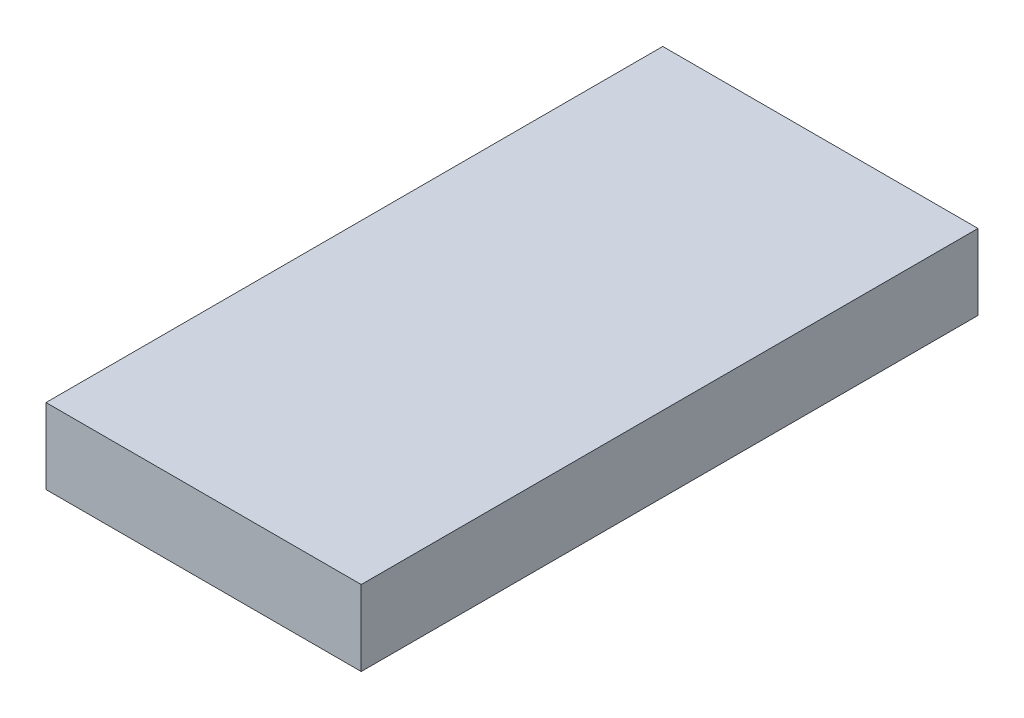
ISO-10303-21;
HEADER;
FILE_DESCRIPTION(('STEP AP214'),'2;1');
FILE_NAME('part.step','',(''),(''),'','','');
FILE_SCHEMA(('AUTOMOTIVE_DESIGN { 1 0 10303 214 1 1 1 1 }'));
ENDSEC;
DATA;
#1=APPLICATION_CONTEXT('core data for automotive mechanical design processes');
#2=APPLICATION_PROTOCOL_DEFINITION('international standard','automotive_design',2000,#1);
#3=PRODUCT_CONTEXT('',#1,'mechanical');
#4=PRODUCT('Part','Part','',(#3));
#5=PRODUCT_RELATED_PRODUCT_CATEGORY('part','',(#4));
#6=PRODUCT_DEFINITION_FORMATION('','',#4);
#7=PRODUCT_DEFINITION_CONTEXT('part definition',#1,'design');
#8=PRODUCT_DEFINITION('design','',#6,#7);
#9=PRODUCT_DEFINITION_SHAPE('','',#8);
#10=(LENGTH_UNIT() NAMED_UNIT(*) SI_UNIT(.MILLI.,.METRE.));
#11=(NAMED_UNIT(*) PLANE_ANGLE_UNIT() SI_UNIT($,.RADIAN.));
#12=(NAMED_UNIT(*) SI_UNIT($,.STERADIAN.) SOLID_ANGLE_UNIT());
#13=UNCERTAINTY_MEASURE_WITH_UNIT(LENGTH_MEASURE(1.E-05),#10,'distance_accuracy_value','');
#14=(GEOMETRIC_REPRESENTATION_CONTEXT(3) GLOBAL_UNCERTAINTY_ASSIGNED_CONTEXT((#13)) GLOBAL_UNIT_ASSIGNED_CONTEXT((#10,
#11,#12)) REPRESENTATION_CONTEXT('',''));
#15=CARTESIAN_POINT('',(0.,0.,0.));
#16=DIRECTION('',(0.,0.,1.));
#17=DIRECTION('',(1.,0.,0.));
#18=AXIS2_PLACEMENT_3D('',#15,#16,#17);
#19=CARTESIAN_POINT('',(-230.,110.,450.));
#20=DIRECTION('',(1.,0.,0.));
#21=DIRECTION('',(0.,0.,-1.));
#22=AXIS2_PLACEMENT_3D('',#19,#20,#21);
#23=PLANE('',#22);
#24=DIRECTION('',(0.,0.,1.));
#25=VECTOR('',#24,1.);
#26=CARTESIAN_POINT('',(-230.,0.,450.));
#27=LINE('',#26,#25);
#28=CARTESIAN_POINT('',(-230.,0.,-450.));
#29=VERTEX_POINT('',#28);
#30=CARTESIAN_POINT('',(-230.,0.,450.));
#31=VERTEX_POINT('',#30);
#32=EDGE_CURVE('E98',#29,#31,#27,.T.);
#33=ORIENTED_EDGE('',*,*,#32,.T.);
#34=DIRECTION('',(0.,-1.,0.));
#35=VECTOR('',#34,1.);
#36=CARTESIAN_POINT('',(-230.,110.,450.));
#37=LINE('',#36,#35);
#38=CARTESIAN_POINT('',(-230.,110.,450.));
#39=VERTEX_POINT('',#38);
#40=EDGE_CURVE('E11',#39,#31,#37,.T.);
#41=ORIENTED_EDGE('',*,*,#40,.F.);
#42=DIRECTION('',(0.,0.,1.));
#43=VECTOR('',#42,1.);
#44=CARTESIAN_POINT('',(-230.,110.,450.));
#45=LINE('',#44,#43);
#46=CARTESIAN_POINT('',(-230.,110.,-450.));
#47=VERTEX_POINT('',#46);
#48=EDGE_CURVE('E86',#47,#39,#45,.T.);
#49=ORIENTED_EDGE('',*,*,#48,.F.);
#50=DIRECTION('',(0.,-1.,0.));
#51=VECTOR('',#50,1.);
#52=CARTESIAN_POINT('',(-230.,110.,-450.));
#53=LINE('',#52,#51);
#54=EDGE_CURVE('E94',#47,#29,#53,.T.);
#55=ORIENTED_EDGE('',*,*,#54,.T.);
#56=EDGE_LOOP('',(#33,#41,#49,#55));
#57=FACE_BOUND('',#56,.T.);
#58=ADVANCED_FACE('F35',(#57),#23,.F.);
#59=CARTESIAN_POINT('',(230.,110.,450.));
#60=DIRECTION('',(0.,0.,-1.));
#61=DIRECTION('',(-1.,0.,0.));
#62=AXIS2_PLACEMENT_3D('',#59,#60,#61);
#63=PLANE('',#62);
#64=DIRECTION('',(1.,0.,0.));
#65=VECTOR('',#64,1.);
#66=CARTESIAN_POINT('',(230.,0.,450.));
#67=LINE('',#66,#65);
#68=CARTESIAN_POINT('',(230.,0.,450.));
#69=VERTEX_POINT('',#68);
#70=EDGE_CURVE('E90',#31,#69,#67,.T.);
#71=ORIENTED_EDGE('',*,*,#70,.T.);
#72=DIRECTION('',(0.,-1.,0.));
#73=VECTOR('',#72,1.);
#74=CARTESIAN_POINT('',(230.,110.,450.));
#75=LINE('',#74,#73);
#76=CARTESIAN_POINT('',(230.,110.,450.));
#77=VERTEX_POINT('',#76);
#78=EDGE_CURVE('E43',#77,#69,#75,.T.);
#79=ORIENTED_EDGE('',*,*,#78,.F.);
#80=DIRECTION('',(1.,0.,0.));
#81=VECTOR('',#80,1.);
#82=CARTESIAN_POINT('',(230.,110.,450.));
#83=LINE('',#82,#81);
#84=EDGE_CURVE('E81',#39,#77,#83,.T.);
#85=ORIENTED_EDGE('',*,*,#84,.F.);
#86=ORIENTED_EDGE('',*,*,#40,.T.);
#87=EDGE_LOOP('',(#71,#79,#85,#86));
#88=FACE_BOUND('',#87,.T.);
#89=ADVANCED_FACE('F89',(#88),#63,.F.);
#90=CARTESIAN_POINT('',(230.,110.,450.));
#91=DIRECTION('',(-1.,0.,0.));
#92=DIRECTION('',(0.,0.,1.));
#93=AXIS2_PLACEMENT_3D('',#90,#91,#92);
#94=PLANE('',#93);
#95=DIRECTION('',(0.,0.,-1.));
#96=VECTOR('',#95,1.);
#97=CARTESIAN_POINT('',(230.,0.,450.));
#98=LINE('',#97,#96);
#99=CARTESIAN_POINT('',(230.,0.,-450.));
#100=VERTEX_POINT('',#99);
#101=EDGE_CURVE('E68',#69,#100,#98,.T.);
#102=ORIENTED_EDGE('',*,*,#101,.T.);
#103=DIRECTION('',(0.,-1.,0.));
#104=VECTOR('',#103,1.);
#105=CARTESIAN_POINT('',(230.,110.,-450.));
#106=LINE('',#105,#104);
#107=CARTESIAN_POINT('',(230.,110.,-450.));
#108=VERTEX_POINT('',#107);
#109=EDGE_CURVE('E91',#108,#100,#106,.T.);
#110=ORIENTED_EDGE('',*,*,#109,.F.);
#111=DIRECTION('',(0.,0.,-1.));
#112=VECTOR('',#111,1.);
#113=CARTESIAN_POINT('',(230.,110.,450.));
#114=LINE('',#113,#112);
#115=EDGE_CURVE('E84',#77,#108,#114,.T.);
#116=ORIENTED_EDGE('',*,*,#115,.F.);
#117=ORIENTED_EDGE('',*,*,#78,.T.);
#118=EDGE_LOOP('',(#102,#110,#116,#117));
#119=FACE_BOUND('',#118,.T.);
#120=ADVANCED_FACE('F92',(#119),#94,.F.);
#121=CARTESIAN_POINT('',(230.,110.,-450.));
#122=DIRECTION('',(0.,0.,1.));
#123=DIRECTION('',(1.,0.,0.));
#124=AXIS2_PLACEMENT_3D('',#121,#122,#123);
#125=PLANE('',#124);
#126=DIRECTION('',(-1.,0.,0.));
#127=VECTOR('',#126,1.);
#128=CARTESIAN_POINT('',(230.,0.,-450.));
#129=LINE('',#128,#127);
#130=EDGE_CURVE('E74',#100,#29,#129,.T.);
#131=ORIENTED_EDGE('',*,*,#130,.T.);
#132=ORIENTED_EDGE('',*,*,#54,.F.);
#133=DIRECTION('',(-1.,0.,0.));
#134=VECTOR('',#133,1.);
#135=CARTESIAN_POINT('',(230.,110.,-450.));
#136=LINE('',#135,#134);
#137=EDGE_CURVE('E51',#108,#47,#136,.T.);
#138=ORIENTED_EDGE('',*,*,#137,.F.);
#139=ORIENTED_EDGE('',*,*,#109,.T.);
#140=EDGE_LOOP('',(#131,#132,#138,#139));
#141=FACE_BOUND('',#140,.T.);
#142=ADVANCED_FACE('F105',(#141),#125,.F.);
#143=CARTESIAN_POINT('',(0.,110.,0.));
#144=DIRECTION('',(0.,1.,0.));
#145=DIRECTION('',(0.,0.,1.));
#146=AXIS2_PLACEMENT_3D('',#143,#144,#145);
#147=PLANE('',#146);
#148=ORIENTED_EDGE('',*,*,#48,.T.);
#149=ORIENTED_EDGE('',*,*,#84,.T.);
#150=ORIENTED_EDGE('',*,*,#115,.T.);
#151=ORIENTED_EDGE('',*,*,#137,.T.);
#152=EDGE_LOOP('',(#148,#149,#150,#151));
#153=FACE_BOUND('',#152,.T.);
#154=ADVANCED_FACE('F82',(#153),#147,.T.);
#155=CARTESIAN_POINT('',(0.,0.,0.));
#156=DIRECTION('',(0.,1.,0.));
#157=DIRECTION('',(0.,0.,1.));
#158=AXIS2_PLACEMENT_3D('',#155,#156,#157);
#159=PLANE('',#158);
#160=ORIENTED_EDGE('',*,*,#32,.F.);
#161=ORIENTED_EDGE('',*,*,#130,.F.);
#162=ORIENTED_EDGE('',*,*,#101,.F.);
#163=ORIENTED_EDGE('',*,*,#70,.F.);
#164=EDGE_LOOP('',(#160,#161,#162,#163));
#165=FACE_BOUND('',#164,.T.);
#166=ADVANCED_FACE('F108',(#165),#159,.F.);
#167=CLOSED_SHELL('',(#58,#89,#120,#142,#154,#166));
#168=MANIFOLD_SOLID_BREP('B2',#167);
#169=ADVANCED_BREP_SHAPE_REPRESENTATION('',(#18,#168),#14);
#170=SHAPE_DEFINITION_REPRESENTATION(#9,#169);
ENDSEC;
END-ISO-10303-21;
